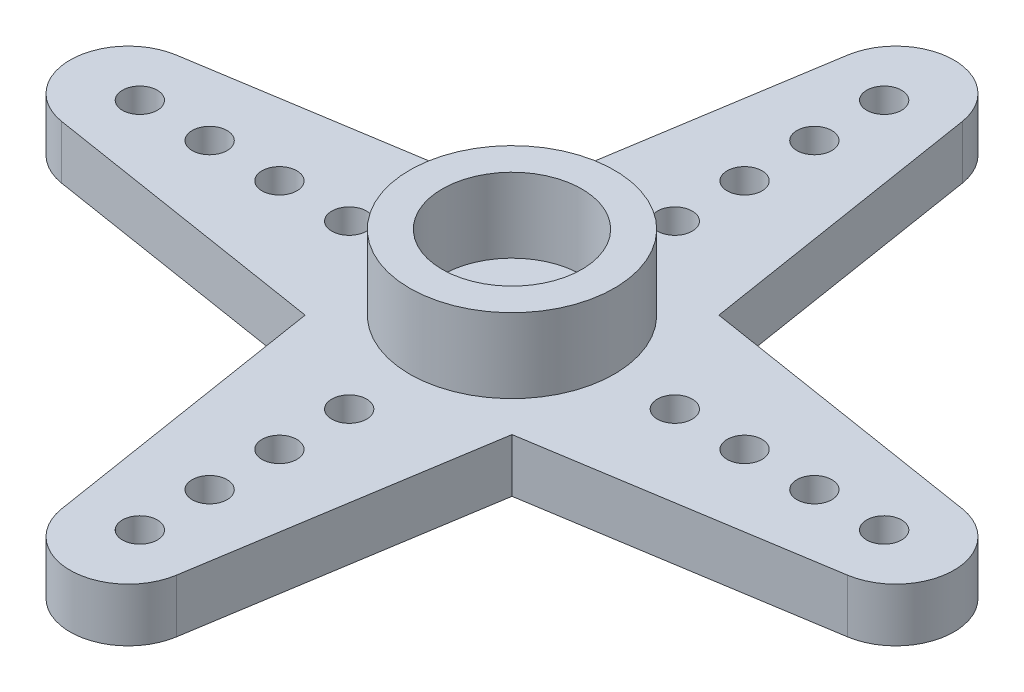
ISO-10303-21;
HEADER;
FILE_DESCRIPTION(('STEP AP214'),'2;1');
FILE_NAME('part.step','',(''),(''),'','','');
FILE_SCHEMA(('AUTOMOTIVE_DESIGN { 1 0 10303 214 1 1 1 1 }'));
ENDSEC;
DATA;
#1=APPLICATION_CONTEXT('core data for automotive mechanical design processes');
#2=APPLICATION_PROTOCOL_DEFINITION('international standard','automotive_design',2000,#1);
#3=PRODUCT_CONTEXT('',#1,'mechanical');
#4=PRODUCT('Part','Part','',(#3));
#5=PRODUCT_RELATED_PRODUCT_CATEGORY('part','',(#4));
#6=PRODUCT_DEFINITION_FORMATION('','',#4);
#7=PRODUCT_DEFINITION_CONTEXT('part definition',#1,'design');
#8=PRODUCT_DEFINITION('design','',#6,#7);
#9=PRODUCT_DEFINITION_SHAPE('','',#8);
#10=(LENGTH_UNIT() NAMED_UNIT(*) SI_UNIT(.MILLI.,.METRE.));
#11=(NAMED_UNIT(*) PLANE_ANGLE_UNIT() SI_UNIT($,.RADIAN.));
#12=(NAMED_UNIT(*) SI_UNIT($,.STERADIAN.) SOLID_ANGLE_UNIT());
#13=UNCERTAINTY_MEASURE_WITH_UNIT(LENGTH_MEASURE(1.E-05),#10,'distance_accuracy_value','');
#14=(GEOMETRIC_REPRESENTATION_CONTEXT(3) GLOBAL_UNCERTAINTY_ASSIGNED_CONTEXT((#13)) GLOBAL_UNIT_ASSIGNED_CONTEXT((#10,
#11,#12)) REPRESENTATION_CONTEXT('',''));
#15=CARTESIAN_POINT('',(0.,0.,0.));
#16=DIRECTION('',(0.,0.,1.));
#17=DIRECTION('',(1.,0.,0.));
#18=AXIS2_PLACEMENT_3D('',#15,#16,#17);
#19=CARTESIAN_POINT('',(5.02767726414761,2.3,-0.799360567392308));
#20=DIRECTION('',(0.987595455307073,0.,-0.157019797021949));
#21=DIRECTION('',(-0.157019797021949,0.,-0.987595455307074));
#22=AXIS2_PLACEMENT_3D('',#19,#20,#21);
#23=PLANE('',#22);
#24=DIRECTION('',(0.157019797021949,0.,0.987595455307074));
#25=VECTOR('',#24,1.);
#26=CARTESIAN_POINT('',(5.02767726414761,2.3,-0.799360567392308));
#27=LINE('',#26,#25);
#28=CARTESIAN_POINT('',(2.46898863826769,2.3,-16.8925494925549));
#29=VERTEX_POINT('',#28);
#30=CARTESIAN_POINT('',(4.44763132459011,2.3,-4.44763132459009));
#31=VERTEX_POINT('',#30);
#32=EDGE_CURVE('E112',#29,#31,#27,.T.);
#33=ORIENTED_EDGE('',*,*,#32,.T.);
#34=DIRECTION('',(0.,-1.,0.));
#35=VECTOR('',#34,1.);
#36=CARTESIAN_POINT('',(4.44763132459011,2.3,-4.44763132459009));
#37=LINE('',#36,#35);
#38=CARTESIAN_POINT('',(4.44763132459011,0.,-4.44763132459009));
#39=VERTEX_POINT('',#38);
#40=EDGE_CURVE('E11',#31,#39,#37,.T.);
#41=ORIENTED_EDGE('',*,*,#40,.T.);
#42=DIRECTION('',(0.157019797021949,0.,0.987595455307074));
#43=VECTOR('',#42,1.);
#44=CARTESIAN_POINT('',(5.02767726414761,0.,-0.799360567392308));
#45=LINE('',#44,#43);
#46=CARTESIAN_POINT('',(2.46898863826769,0.,-16.8925494925549));
#47=VERTEX_POINT('',#46);
#48=EDGE_CURVE('E94',#47,#39,#45,.T.);
#49=ORIENTED_EDGE('',*,*,#48,.F.);
#50=DIRECTION('',(0.,-1.,0.));
#51=VECTOR('',#50,1.);
#52=CARTESIAN_POINT('',(2.46898863826769,2.3,-16.8925494925549));
#53=LINE('',#52,#51);
#54=EDGE_CURVE('E66',#29,#47,#53,.T.);
#55=ORIENTED_EDGE('',*,*,#54,.F.);
#56=EDGE_LOOP('',(#33,#41,#49,#55));
#57=FACE_BOUND('',#56,.T.);
#58=ADVANCED_FACE('F41',(#57),#23,.T.);
#59=CARTESIAN_POINT('',(0.,2.3,0.));
#60=DIRECTION('',(0.,1.,0.));
#61=DIRECTION('',(0.,0.,1.));
#62=AXIS2_PLACEMENT_3D('',#59,#60,#61);
#63=PLANE('',#62);
#64=CARTESIAN_POINT('',(0.,2.3,0.));
#65=DIRECTION('',(0.,1.,0.));
#66=DIRECTION('',(0.,0.,1.));
#67=AXIS2_PLACEMENT_3D('',#64,#65,#66);
#68=CIRCLE('',#67,1.5);
#69=CARTESIAN_POINT('',(0.,2.3,1.5));
#70=VERTEX_POINT('',#69);
#71=EDGE_CURVE('E129',#70,#70,#68,.T.);
#72=ORIENTED_EDGE('',*,*,#71,.F.);
#73=EDGE_LOOP('',(#72));
#74=FACE_BOUND('',#73,.T.);
#75=CARTESIAN_POINT('',(0.,2.3,0.));
#76=DIRECTION('',(0.,1.,0.));
#77=DIRECTION('',(0.,0.,1.));
#78=AXIS2_PLACEMENT_3D('',#75,#76,#77);
#79=CIRCLE('',#78,3.);
#80=CARTESIAN_POINT('',(0.,2.3,3.));
#81=VERTEX_POINT('',#80);
#82=EDGE_CURVE('E85',#81,#81,#79,.T.);
#83=ORIENTED_EDGE('',*,*,#82,.T.);
#84=EDGE_LOOP('',(#83));
#85=FACE_BOUND('',#84,.T.);
#86=ADVANCED_FACE('F409',(#74,#85),#63,.T.);
#87=DIRECTION('',(-0.987595455307073,0.,-0.157019797021953));
#88=VECTOR('',#87,1.);
#89=CARTESIAN_POINT('',(0.799360567392327,2.3,-5.0276772641476));
#90=LINE('',#89,#88);
#91=CARTESIAN_POINT('',(16.8925494925549,2.3,-2.46898863826762));
#92=VERTEX_POINT('',#91);
#93=EDGE_CURVE('E194',#92,#31,#90,.T.);
#94=ORIENTED_EDGE('',*,*,#93,.T.);
#95=ORIENTED_EDGE('',*,*,#32,.F.);
#96=CARTESIAN_POINT('',(0.,2.3,-16.5));
#97=DIRECTION('',(0.,-1.,0.));
#98=DIRECTION('',(0.,0.,-1.));
#99=AXIS2_PLACEMENT_3D('',#96,#97,#98);
#100=CIRCLE('',#99,2.5);
#101=CARTESIAN_POINT('',(-2.46898863826768,2.3,-16.8925494925549));
#102=VERTEX_POINT('',#101);
#103=EDGE_CURVE('E82',#102,#29,#100,.T.);
#104=ORIENTED_EDGE('',*,*,#103,.F.);
#105=DIRECTION('',(-0.15701979702195,0.,0.987595455307073));
#106=VECTOR('',#105,1.);
#107=CARTESIAN_POINT('',(-5.02767726414761,2.3,-0.799360567392309));
#108=LINE('',#107,#106);
#109=CARTESIAN_POINT('',(-4.4476313245901,2.3,-4.44763132459014));
#110=VERTEX_POINT('',#109);
#111=EDGE_CURVE('E140',#102,#110,#108,.T.);
#112=ORIENTED_EDGE('',*,*,#111,.T.);
#113=DIRECTION('',(0.987595455307075,0.,-0.157019797021939));
#114=VECTOR('',#113,1.);
#115=CARTESIAN_POINT('',(-0.799360567392255,2.3,-5.02767726414762));
#116=LINE('',#115,#114);
#117=CARTESIAN_POINT('',(-16.8925494925548,2.3,-2.46898863826786));
#118=VERTEX_POINT('',#117);
#119=EDGE_CURVE('E57',#118,#110,#116,.T.);
#120=ORIENTED_EDGE('',*,*,#119,.F.);
#121=CARTESIAN_POINT('',(-16.5,2.3,-1.74848993491328E-13));
#122=DIRECTION('',(0.,-1.,0.));
#123=DIRECTION('',(-1.,0.,0.));
#124=AXIS2_PLACEMENT_3D('',#121,#122,#123);
#125=CIRCLE('',#124,2.5);
#126=CARTESIAN_POINT('',(-16.8925494925549,2.3,2.46898863826751));
#127=VERTEX_POINT('',#126);
#128=EDGE_CURVE('E323',#127,#118,#125,.T.);
#129=ORIENTED_EDGE('',*,*,#128,.F.);
#130=DIRECTION('',(0.987595455307072,0.,0.15701979702196));
#131=VECTOR('',#130,1.);
#132=CARTESIAN_POINT('',(-0.799360567392362,2.3,5.0276772641476));
#133=LINE('',#132,#131);
#134=CARTESIAN_POINT('',(-4.44763132459011,2.3,4.44763132459006));
#135=VERTEX_POINT('',#134);
#136=EDGE_CURVE('E327',#127,#135,#133,.T.);
#137=ORIENTED_EDGE('',*,*,#136,.T.);
#138=DIRECTION('',(-0.157019797021949,0.,-0.987595455307074));
#139=VECTOR('',#138,1.);
#140=CARTESIAN_POINT('',(-5.02767726414761,2.3,0.799360567392308));
#141=LINE('',#140,#139);
#142=CARTESIAN_POINT('',(-2.46898863826769,2.3,16.8925494925549));
#143=VERTEX_POINT('',#142);
#144=EDGE_CURVE('E253',#143,#135,#141,.T.);
#145=ORIENTED_EDGE('',*,*,#144,.F.);
#146=CARTESIAN_POINT('',(0.,2.3,16.5));
#147=DIRECTION('',(0.,-1.,0.));
#148=DIRECTION('',(0.,0.,1.));
#149=AXIS2_PLACEMENT_3D('',#146,#147,#148);
#150=CIRCLE('',#149,2.5);
#151=CARTESIAN_POINT('',(2.46898863826768,2.3,16.8925494925549));
#152=VERTEX_POINT('',#151);
#153=EDGE_CURVE('E257',#152,#143,#150,.T.);
#154=ORIENTED_EDGE('',*,*,#153,.F.);
#155=DIRECTION('',(0.15701979702195,0.,-0.987595455307073));
#156=VECTOR('',#155,1.);
#157=CARTESIAN_POINT('',(5.02767726414761,2.3,0.799360567392309));
#158=LINE('',#157,#156);
#159=CARTESIAN_POINT('',(4.4476313245901,2.3,4.44763132459012));
#160=VERTEX_POINT('',#159);
#161=EDGE_CURVE('E261',#152,#160,#158,.T.);
#162=ORIENTED_EDGE('',*,*,#161,.T.);
#163=DIRECTION('',(-0.987595455307074,0.,0.157019797021946));
#164=VECTOR('',#163,1.);
#165=CARTESIAN_POINT('',(0.79936056739229,2.3,5.02767726414761));
#166=LINE('',#165,#164);
#167=CARTESIAN_POINT('',(16.8925494925549,2.3,2.46898863826775));
#168=VERTEX_POINT('',#167);
#169=EDGE_CURVE('E186',#168,#160,#166,.T.);
#170=ORIENTED_EDGE('',*,*,#169,.F.);
#171=CARTESIAN_POINT('',(16.5,2.3,0.));
#172=DIRECTION('',(0.,-1.,0.));
#173=DIRECTION('',(1.,0.,0.));
#174=AXIS2_PLACEMENT_3D('',#171,#172,#173);
#175=CIRCLE('',#174,2.5);
#176=EDGE_CURVE('E190',#92,#168,#175,.T.);
#177=ORIENTED_EDGE('',*,*,#176,.F.);
#178=EDGE_LOOP('',(#94,#95,#104,#112,#120,#129,#137,#145,#154,#162,#170,#177));
#179=FACE_BOUND('',#178,.T.);
#180=CARTESIAN_POINT('',(16.,2.3,0.));
#181=DIRECTION('',(0.,-1.,0.));
#182=DIRECTION('',(1.,0.,0.));
#183=AXIS2_PLACEMENT_3D('',#180,#181,#182);
#184=CIRCLE('',#183,0.75);
#185=CARTESIAN_POINT('',(16.75,2.3,0.));
#186=VERTEX_POINT('',#185);
#187=EDGE_CURVE('E197',#186,#186,#184,.T.);
#188=ORIENTED_EDGE('',*,*,#187,.T.);
#189=EDGE_LOOP('',(#188));
#190=FACE_BOUND('',#189,.T.);
#191=CARTESIAN_POINT('',(13.,2.3,0.));
#192=DIRECTION('',(0.,-1.,0.));
#193=DIRECTION('',(1.,0.,0.));
#194=AXIS2_PLACEMENT_3D('',#191,#192,#193);
#195=CIRCLE('',#194,0.750000000000001);
#196=CARTESIAN_POINT('',(13.75,2.3,0.));
#197=VERTEX_POINT('',#196);
#198=EDGE_CURVE('E201',#197,#197,#195,.T.);
#199=ORIENTED_EDGE('',*,*,#198,.T.);
#200=EDGE_LOOP('',(#199));
#201=FACE_BOUND('',#200,.T.);
#202=CARTESIAN_POINT('',(10.,2.3,0.));
#203=DIRECTION('',(0.,-1.,0.));
#204=DIRECTION('',(1.,0.,0.));
#205=AXIS2_PLACEMENT_3D('',#202,#203,#204);
#206=CIRCLE('',#205,0.750000000000001);
#207=CARTESIAN_POINT('',(10.75,2.3,0.));
#208=VERTEX_POINT('',#207);
#209=EDGE_CURVE('E205',#208,#208,#206,.T.);
#210=ORIENTED_EDGE('',*,*,#209,.T.);
#211=EDGE_LOOP('',(#210));
#212=FACE_BOUND('',#211,.T.);
#213=CARTESIAN_POINT('',(7.,2.3,0.));
#214=DIRECTION('',(0.,-1.,0.));
#215=DIRECTION('',(1.,0.,0.));
#216=AXIS2_PLACEMENT_3D('',#213,#214,#215);
#217=CIRCLE('',#216,0.75);
#218=CARTESIAN_POINT('',(7.75,2.3,0.));
#219=VERTEX_POINT('',#218);
#220=EDGE_CURVE('E209',#219,#219,#217,.T.);
#221=ORIENTED_EDGE('',*,*,#220,.T.);
#222=EDGE_LOOP('',(#221));
#223=FACE_BOUND('',#222,.T.);
#224=CARTESIAN_POINT('',(0.,2.3,16.));
#225=DIRECTION('',(0.,-1.,0.));
#226=DIRECTION('',(0.,0.,1.));
#227=AXIS2_PLACEMENT_3D('',#224,#225,#226);
#228=CIRCLE('',#227,0.75);
#229=CARTESIAN_POINT('',(0.,2.3,16.75));
#230=VERTEX_POINT('',#229);
#231=EDGE_CURVE('E265',#230,#230,#228,.T.);
#232=ORIENTED_EDGE('',*,*,#231,.T.);
#233=EDGE_LOOP('',(#232));
#234=FACE_BOUND('',#233,.T.);
#235=CARTESIAN_POINT('',(0.,2.3,13.));
#236=DIRECTION('',(0.,-1.,0.));
#237=DIRECTION('',(0.,0.,1.));
#238=AXIS2_PLACEMENT_3D('',#235,#236,#237);
#239=CIRCLE('',#238,0.750000000000001);
#240=CARTESIAN_POINT('',(0.,2.3,13.75));
#241=VERTEX_POINT('',#240);
#242=EDGE_CURVE('E269',#241,#241,#239,.T.);
#243=ORIENTED_EDGE('',*,*,#242,.T.);
#244=EDGE_LOOP('',(#243));
#245=FACE_BOUND('',#244,.T.);
#246=CARTESIAN_POINT('',(0.,2.3,10.));
#247=DIRECTION('',(0.,-1.,0.));
#248=DIRECTION('',(0.,0.,1.));
#249=AXIS2_PLACEMENT_3D('',#246,#247,#248);
#250=CIRCLE('',#249,0.750000000000001);
#251=CARTESIAN_POINT('',(0.,2.3,10.75));
#252=VERTEX_POINT('',#251);
#253=EDGE_CURVE('E273',#252,#252,#250,.T.);
#254=ORIENTED_EDGE('',*,*,#253,.T.);
#255=EDGE_LOOP('',(#254));
#256=FACE_BOUND('',#255,.T.);
#257=CARTESIAN_POINT('',(0.,2.3,7.));
#258=DIRECTION('',(0.,-1.,0.));
#259=DIRECTION('',(0.,0.,1.));
#260=AXIS2_PLACEMENT_3D('',#257,#258,#259);
#261=CIRCLE('',#260,0.75);
#262=CARTESIAN_POINT('',(0.,2.3,7.75));
#263=VERTEX_POINT('',#262);
#264=EDGE_CURVE('E277',#263,#263,#261,.T.);
#265=ORIENTED_EDGE('',*,*,#264,.T.);
#266=EDGE_LOOP('',(#265));
#267=FACE_BOUND('',#266,.T.);
#268=CARTESIAN_POINT('',(-7.,2.3,0.));
#269=DIRECTION('',(0.,-1.,0.));
#270=DIRECTION('',(-1.,0.,0.));
#271=AXIS2_PLACEMENT_3D('',#268,#269,#270);
#272=CIRCLE('',#271,0.75);
#273=CARTESIAN_POINT('',(-7.75,2.3,0.));
#274=VERTEX_POINT('',#273);
#275=EDGE_CURVE('E343',#274,#274,#272,.T.);
#276=ORIENTED_EDGE('',*,*,#275,.T.);
#277=EDGE_LOOP('',(#276));
#278=FACE_BOUND('',#277,.T.);
#279=CARTESIAN_POINT('',(-10.,2.3,-1.05969086964441E-13));
#280=DIRECTION('',(0.,-1.,0.));
#281=DIRECTION('',(-1.,0.,0.));
#282=AXIS2_PLACEMENT_3D('',#279,#280,#281);
#283=CIRCLE('',#282,0.750000000000001);
#284=CARTESIAN_POINT('',(-10.75,2.3,-1.13824919976838E-13));
#285=VERTEX_POINT('',#284);
#286=EDGE_CURVE('E339',#285,#285,#283,.T.);
#287=ORIENTED_EDGE('',*,*,#286,.T.);
#288=EDGE_LOOP('',(#287));
#289=FACE_BOUND('',#288,.T.);
#290=CARTESIAN_POINT('',(-13.,2.3,-1.37759813053774E-13));
#291=DIRECTION('',(0.,-1.,0.));
#292=DIRECTION('',(-1.,0.,0.));
#293=AXIS2_PLACEMENT_3D('',#290,#291,#292);
#294=CIRCLE('',#293,0.750000000000001);
#295=CARTESIAN_POINT('',(-13.75,2.3,-1.45615646066171E-13));
#296=VERTEX_POINT('',#295);
#297=EDGE_CURVE('E335',#296,#296,#294,.T.);
#298=ORIENTED_EDGE('',*,*,#297,.T.);
#299=EDGE_LOOP('',(#298));
#300=FACE_BOUND('',#299,.T.);
#301=CARTESIAN_POINT('',(-16.,2.3,-1.69550539143106E-13));
#302=DIRECTION('',(0.,-1.,0.));
#303=DIRECTION('',(-1.,0.,0.));
#304=AXIS2_PLACEMENT_3D('',#301,#302,#303);
#305=CIRCLE('',#304,0.75);
#306=CARTESIAN_POINT('',(-16.75,2.3,-1.77406372155503E-13));
#307=VERTEX_POINT('',#306);
#308=EDGE_CURVE('E331',#307,#307,#305,.T.);
#309=ORIENTED_EDGE('',*,*,#308,.T.);
#310=EDGE_LOOP('',(#309));
#311=FACE_BOUND('',#310,.T.);
#312=CARTESIAN_POINT('',(0.,2.3,0.));
#313=DIRECTION('',(0.,1.,0.));
#314=DIRECTION('',(0.,0.,1.));
#315=AXIS2_PLACEMENT_3D('',#312,#313,#314);
#316=CIRCLE('',#315,4.4);
#317=CARTESIAN_POINT('',(0.,2.3,4.4));
#318=VERTEX_POINT('',#317);
#319=EDGE_CURVE('E125',#318,#318,#316,.T.);
#320=ORIENTED_EDGE('',*,*,#319,.F.);
#321=EDGE_LOOP('',(#320));
#322=FACE_BOUND('',#321,.T.);
#323=CARTESIAN_POINT('',(0.,2.3,-7.));
#324=DIRECTION('',(0.,-1.,0.));
#325=DIRECTION('',(0.,0.,-1.));
#326=AXIS2_PLACEMENT_3D('',#323,#324,#325);
#327=CIRCLE('',#326,0.75);
#328=CARTESIAN_POINT('',(0.,2.3,-7.75));
#329=VERTEX_POINT('',#328);
#330=EDGE_CURVE('E102',#329,#329,#327,.T.);
#331=ORIENTED_EDGE('',*,*,#330,.T.);
#332=EDGE_LOOP('',(#331));
#333=FACE_BOUND('',#332,.T.);
#334=CARTESIAN_POINT('',(0.,2.3,-10.));
#335=DIRECTION('',(0.,-1.,0.));
#336=DIRECTION('',(0.,0.,-1.));
#337=AXIS2_PLACEMENT_3D('',#334,#335,#336);
#338=CIRCLE('',#337,0.750000000000001);
#339=CARTESIAN_POINT('',(0.,2.3,-10.75));
#340=VERTEX_POINT('',#339);
#341=EDGE_CURVE('E106',#340,#340,#338,.T.);
#342=ORIENTED_EDGE('',*,*,#341,.T.);
#343=EDGE_LOOP('',(#342));
#344=FACE_BOUND('',#343,.T.);
#345=CARTESIAN_POINT('',(0.,2.3,-13.));
#346=DIRECTION('',(0.,-1.,0.));
#347=DIRECTION('',(0.,0.,-1.));
#348=AXIS2_PLACEMENT_3D('',#345,#346,#347);
#349=CIRCLE('',#348,0.750000000000001);
#350=CARTESIAN_POINT('',(0.,2.3,-13.75));
#351=VERTEX_POINT('',#350);
#352=EDGE_CURVE('E156',#351,#351,#349,.T.);
#353=ORIENTED_EDGE('',*,*,#352,.T.);
#354=EDGE_LOOP('',(#353));
#355=FACE_BOUND('',#354,.T.);
#356=CARTESIAN_POINT('',(0.,2.3,-16.));
#357=DIRECTION('',(0.,-1.,0.));
#358=DIRECTION('',(0.,0.,-1.));
#359=AXIS2_PLACEMENT_3D('',#356,#357,#358);
#360=CIRCLE('',#359,0.75);
#361=CARTESIAN_POINT('',(0.,2.3,-16.75));
#362=VERTEX_POINT('',#361);
#363=EDGE_CURVE('E150',#362,#362,#360,.T.);
#364=ORIENTED_EDGE('',*,*,#363,.T.);
#365=EDGE_LOOP('',(#364));
#366=FACE_BOUND('',#365,.T.);
#367=ADVANCED_FACE('F145',(#179,#190,#201,#212,#223,#234,#245,#256,#267,#278,#289,#300,#311,
#322,#333,#344,#355,#366),#63,.T.);
#368=CARTESIAN_POINT('',(0.,0.,0.));
#369=DIRECTION('',(0.,1.,0.));
#370=DIRECTION('',(0.,0.,1.));
#371=AXIS2_PLACEMENT_3D('',#368,#369,#370);
#372=PLANE('',#371);
#373=ORIENTED_EDGE('',*,*,#48,.T.);
#374=DIRECTION('',(-0.987595455307073,0.,-0.157019797021953));
#375=VECTOR('',#374,1.);
#376=CARTESIAN_POINT('',(0.799360567392327,0.,-5.0276772641476));
#377=LINE('',#376,#375);
#378=CARTESIAN_POINT('',(16.8925494925549,0.,-2.46898863826762));
#379=VERTEX_POINT('',#378);
#380=EDGE_CURVE('E221',#379,#39,#377,.T.);
#381=ORIENTED_EDGE('',*,*,#380,.F.);
#382=CARTESIAN_POINT('',(16.5,0.,0.));
#383=DIRECTION('',(0.,-1.,0.));
#384=DIRECTION('',(1.,0.,0.));
#385=AXIS2_PLACEMENT_3D('',#382,#383,#384);
#386=CIRCLE('',#385,2.5);
#387=CARTESIAN_POINT('',(16.8925494925549,0.,2.46898863826775));
#388=VERTEX_POINT('',#387);
#389=EDGE_CURVE('E217',#379,#388,#386,.T.);
#390=ORIENTED_EDGE('',*,*,#389,.T.);
#391=DIRECTION('',(-0.987595455307074,0.,0.157019797021946));
#392=VECTOR('',#391,1.);
#393=CARTESIAN_POINT('',(0.79936056739229,0.,5.02767726414761));
#394=LINE('',#393,#392);
#395=CARTESIAN_POINT('',(4.4476313245901,0.,4.44763132459012));
#396=VERTEX_POINT('',#395);
#397=EDGE_CURVE('E213',#388,#396,#394,.T.);
#398=ORIENTED_EDGE('',*,*,#397,.T.);
#399=DIRECTION('',(0.15701979702195,0.,-0.987595455307073));
#400=VECTOR('',#399,1.);
#401=CARTESIAN_POINT('',(5.02767726414761,0.,0.799360567392309));
#402=LINE('',#401,#400);
#403=CARTESIAN_POINT('',(2.46898863826768,0.,16.8925494925549));
#404=VERTEX_POINT('',#403);
#405=EDGE_CURVE('E289',#404,#396,#402,.T.);
#406=ORIENTED_EDGE('',*,*,#405,.F.);
#407=CARTESIAN_POINT('',(0.,0.,16.5));
#408=DIRECTION('',(0.,-1.,0.));
#409=DIRECTION('',(0.,0.,1.));
#410=AXIS2_PLACEMENT_3D('',#407,#408,#409);
#411=CIRCLE('',#410,2.5);
#412=CARTESIAN_POINT('',(-2.46898863826769,0.,16.8925494925549));
#413=VERTEX_POINT('',#412);
#414=EDGE_CURVE('E285',#404,#413,#411,.T.);
#415=ORIENTED_EDGE('',*,*,#414,.T.);
#416=DIRECTION('',(-0.157019797021949,0.,-0.987595455307074));
#417=VECTOR('',#416,1.);
#418=CARTESIAN_POINT('',(-5.02767726414761,0.,0.799360567392308));
#419=LINE('',#418,#417);
#420=CARTESIAN_POINT('',(-4.44763132459011,0.,4.44763132459006));
#421=VERTEX_POINT('',#420);
#422=EDGE_CURVE('E281',#413,#421,#419,.T.);
#423=ORIENTED_EDGE('',*,*,#422,.T.);
#424=DIRECTION('',(0.987595455307072,0.,0.15701979702196));
#425=VECTOR('',#424,1.);
#426=CARTESIAN_POINT('',(-0.799360567392362,0.,5.0276772641476));
#427=LINE('',#426,#425);
#428=CARTESIAN_POINT('',(-16.8925494925549,0.,2.46898863826751));
#429=VERTEX_POINT('',#428);
#430=EDGE_CURVE('E354',#429,#421,#427,.T.);
#431=ORIENTED_EDGE('',*,*,#430,.F.);
#432=CARTESIAN_POINT('',(-16.5,0.,-1.74848993491328E-13));
#433=DIRECTION('',(0.,-1.,0.));
#434=DIRECTION('',(-1.,0.,0.));
#435=AXIS2_PLACEMENT_3D('',#432,#433,#434);
#436=CIRCLE('',#435,2.5);
#437=CARTESIAN_POINT('',(-16.8925494925548,0.,-2.46898863826786));
#438=VERTEX_POINT('',#437);
#439=EDGE_CURVE('E350',#429,#438,#436,.T.);
#440=ORIENTED_EDGE('',*,*,#439,.T.);
#441=DIRECTION('',(0.987595455307075,0.,-0.157019797021939));
#442=VECTOR('',#441,1.);
#443=CARTESIAN_POINT('',(-0.799360567392255,0.,-5.02767726414762));
#444=LINE('',#443,#442);
#445=CARTESIAN_POINT('',(-4.4476313245901,0.,-4.44763132459014));
#446=VERTEX_POINT('',#445);
#447=EDGE_CURVE('E347',#438,#446,#444,.T.);
#448=ORIENTED_EDGE('',*,*,#447,.T.);
#449=DIRECTION('',(-0.15701979702195,0.,0.987595455307073));
#450=VECTOR('',#449,1.);
#451=CARTESIAN_POINT('',(-5.02767726414761,0.,-0.799360567392309));
#452=LINE('',#451,#450);
#453=CARTESIAN_POINT('',(-2.46898863826768,0.,-16.8925494925549));
#454=VERTEX_POINT('',#453);
#455=EDGE_CURVE('E97',#454,#446,#452,.T.);
#456=ORIENTED_EDGE('',*,*,#455,.F.);
#457=CARTESIAN_POINT('',(0.,0.,-16.5));
#458=DIRECTION('',(0.,-1.,0.));
#459=DIRECTION('',(0.,0.,-1.));
#460=AXIS2_PLACEMENT_3D('',#457,#458,#459);
#461=CIRCLE('',#460,2.5);
#462=EDGE_CURVE('E80',#454,#47,#461,.T.);
#463=ORIENTED_EDGE('',*,*,#462,.T.);
#464=EDGE_LOOP('',(#373,#381,#390,#398,#406,#415,#423,#431,#440,#448,#456,#463));
#465=FACE_BOUND('',#464,.T.);
#466=CARTESIAN_POINT('',(-16.,0.,-1.69550539143106E-13));
#467=DIRECTION('',(0.,-1.,0.));
#468=DIRECTION('',(-1.,0.,0.));
#469=AXIS2_PLACEMENT_3D('',#466,#467,#468);
#470=CIRCLE('',#469,0.75);
#471=CARTESIAN_POINT('',(-16.75,0.,-1.77406372155503E-13));
#472=VERTEX_POINT('',#471);
#473=EDGE_CURVE('E358',#472,#472,#470,.T.);
#474=ORIENTED_EDGE('',*,*,#473,.F.);
#475=EDGE_LOOP('',(#474));
#476=FACE_BOUND('',#475,.T.);
#477=CARTESIAN_POINT('',(-13.,0.,-1.37759813053774E-13));
#478=DIRECTION('',(0.,-1.,0.));
#479=DIRECTION('',(-1.,0.,0.));
#480=AXIS2_PLACEMENT_3D('',#477,#478,#479);
#481=CIRCLE('',#480,0.750000000000001);
#482=CARTESIAN_POINT('',(-13.75,0.,-1.45615646066171E-13));
#483=VERTEX_POINT('',#482);
#484=EDGE_CURVE('E362',#483,#483,#481,.T.);
#485=ORIENTED_EDGE('',*,*,#484,.F.);
#486=EDGE_LOOP('',(#485));
#487=FACE_BOUND('',#486,.T.);
#488=CARTESIAN_POINT('',(-10.,0.,-1.05969086964441E-13));
#489=DIRECTION('',(0.,-1.,0.));
#490=DIRECTION('',(-1.,0.,0.));
#491=AXIS2_PLACEMENT_3D('',#488,#489,#490);
#492=CIRCLE('',#491,0.750000000000001);
#493=CARTESIAN_POINT('',(-10.75,0.,-1.13824919976838E-13));
#494=VERTEX_POINT('',#493);
#495=EDGE_CURVE('E366',#494,#494,#492,.T.);
#496=ORIENTED_EDGE('',*,*,#495,.F.);
#497=EDGE_LOOP('',(#496));
#498=FACE_BOUND('',#497,.T.);
#499=CARTESIAN_POINT('',(-7.,0.,0.));
#500=DIRECTION('',(0.,-1.,0.));
#501=DIRECTION('',(-1.,0.,0.));
#502=AXIS2_PLACEMENT_3D('',#499,#500,#501);
#503=CIRCLE('',#502,0.75);
#504=CARTESIAN_POINT('',(-7.75,0.,0.));
#505=VERTEX_POINT('',#504);
#506=EDGE_CURVE('E370',#505,#505,#503,.T.);
#507=ORIENTED_EDGE('',*,*,#506,.F.);
#508=EDGE_LOOP('',(#507));
#509=FACE_BOUND('',#508,.T.);
#510=CARTESIAN_POINT('',(0.,0.,16.));
#511=DIRECTION('',(0.,-1.,0.));
#512=DIRECTION('',(0.,0.,1.));
#513=AXIS2_PLACEMENT_3D('',#510,#511,#512);
#514=CIRCLE('',#513,0.75);
#515=CARTESIAN_POINT('',(0.,0.,16.75));
#516=VERTEX_POINT('',#515);
#517=EDGE_CURVE('E293',#516,#516,#514,.T.);
#518=ORIENTED_EDGE('',*,*,#517,.F.);
#519=EDGE_LOOP('',(#518));
#520=FACE_BOUND('',#519,.T.);
#521=CARTESIAN_POINT('',(0.,0.,13.));
#522=DIRECTION('',(0.,-1.,0.));
#523=DIRECTION('',(0.,0.,1.));
#524=AXIS2_PLACEMENT_3D('',#521,#522,#523);
#525=CIRCLE('',#524,0.750000000000001);
#526=CARTESIAN_POINT('',(0.,0.,13.75));
#527=VERTEX_POINT('',#526);
#528=EDGE_CURVE('E297',#527,#527,#525,.T.);
#529=ORIENTED_EDGE('',*,*,#528,.F.);
#530=EDGE_LOOP('',(#529));
#531=FACE_BOUND('',#530,.T.);
#532=CARTESIAN_POINT('',(0.,0.,10.));
#533=DIRECTION('',(0.,-1.,0.));
#534=DIRECTION('',(0.,0.,1.));
#535=AXIS2_PLACEMENT_3D('',#532,#533,#534);
#536=CIRCLE('',#535,0.750000000000001);
#537=CARTESIAN_POINT('',(0.,0.,10.75));
#538=VERTEX_POINT('',#537);
#539=EDGE_CURVE('E301',#538,#538,#536,.T.);
#540=ORIENTED_EDGE('',*,*,#539,.F.);
#541=EDGE_LOOP('',(#540));
#542=FACE_BOUND('',#541,.T.);
#543=CARTESIAN_POINT('',(0.,0.,7.));
#544=DIRECTION('',(0.,-1.,0.));
#545=DIRECTION('',(0.,0.,1.));
#546=AXIS2_PLACEMENT_3D('',#543,#544,#545);
#547=CIRCLE('',#546,0.75);
#548=CARTESIAN_POINT('',(0.,0.,7.75));
#549=VERTEX_POINT('',#548);
#550=EDGE_CURVE('E305',#549,#549,#547,.T.);
#551=ORIENTED_EDGE('',*,*,#550,.F.);
#552=EDGE_LOOP('',(#551));
#553=FACE_BOUND('',#552,.T.);
#554=CARTESIAN_POINT('',(16.,0.,0.));
#555=DIRECTION('',(0.,-1.,0.));
#556=DIRECTION('',(1.,0.,0.));
#557=AXIS2_PLACEMENT_3D('',#554,#555,#556);
#558=CIRCLE('',#557,0.75);
#559=CARTESIAN_POINT('',(16.75,0.,0.));
#560=VERTEX_POINT('',#559);
#561=EDGE_CURVE('E225',#560,#560,#558,.T.);
#562=ORIENTED_EDGE('',*,*,#561,.F.);
#563=EDGE_LOOP('',(#562));
#564=FACE_BOUND('',#563,.T.);
#565=CARTESIAN_POINT('',(13.,0.,0.));
#566=DIRECTION('',(0.,-1.,0.));
#567=DIRECTION('',(1.,0.,0.));
#568=AXIS2_PLACEMENT_3D('',#565,#566,#567);
#569=CIRCLE('',#568,0.750000000000001);
#570=CARTESIAN_POINT('',(13.75,0.,0.));
#571=VERTEX_POINT('',#570);
#572=EDGE_CURVE('E229',#571,#571,#569,.T.);
#573=ORIENTED_EDGE('',*,*,#572,.F.);
#574=EDGE_LOOP('',(#573));
#575=FACE_BOUND('',#574,.T.);
#576=CARTESIAN_POINT('',(10.,0.,0.));
#577=DIRECTION('',(0.,-1.,0.));
#578=DIRECTION('',(1.,0.,0.));
#579=AXIS2_PLACEMENT_3D('',#576,#577,#578);
#580=CIRCLE('',#579,0.750000000000001);
#581=CARTESIAN_POINT('',(10.75,0.,0.));
#582=VERTEX_POINT('',#581);
#583=EDGE_CURVE('E233',#582,#582,#580,.T.);
#584=ORIENTED_EDGE('',*,*,#583,.F.);
#585=EDGE_LOOP('',(#584));
#586=FACE_BOUND('',#585,.T.);
#587=CARTESIAN_POINT('',(7.,0.,0.));
#588=DIRECTION('',(0.,-1.,0.));
#589=DIRECTION('',(1.,0.,0.));
#590=AXIS2_PLACEMENT_3D('',#587,#588,#589);
#591=CIRCLE('',#590,0.75);
#592=CARTESIAN_POINT('',(7.75,0.,0.));
#593=VERTEX_POINT('',#592);
#594=EDGE_CURVE('E237',#593,#593,#591,.T.);
#595=ORIENTED_EDGE('',*,*,#594,.F.);
#596=EDGE_LOOP('',(#595));
#597=FACE_BOUND('',#596,.T.);
#598=CARTESIAN_POINT('',(0.,0.,0.));
#599=DIRECTION('',(0.,1.,0.));
#600=DIRECTION('',(0.,0.,1.));
#601=AXIS2_PLACEMENT_3D('',#598,#599,#600);
#602=CIRCLE('',#601,1.5);
#603=CARTESIAN_POINT('',(0.,0.,1.5));
#604=VERTEX_POINT('',#603);
#605=EDGE_CURVE('E124',#604,#604,#602,.T.);
#606=ORIENTED_EDGE('',*,*,#605,.T.);
#607=EDGE_LOOP('',(#606));
#608=FACE_BOUND('',#607,.T.);
#609=CARTESIAN_POINT('',(0.,0.,-7.));
#610=DIRECTION('',(0.,-1.,0.));
#611=DIRECTION('',(0.,0.,-1.));
#612=AXIS2_PLACEMENT_3D('',#609,#610,#611);
#613=CIRCLE('',#612,0.75);
#614=CARTESIAN_POINT('',(0.,0.,-7.75));
#615=VERTEX_POINT('',#614);
#616=EDGE_CURVE('E162',#615,#615,#613,.T.);
#617=ORIENTED_EDGE('',*,*,#616,.F.);
#618=EDGE_LOOP('',(#617));
#619=FACE_BOUND('',#618,.T.);
#620=CARTESIAN_POINT('',(0.,0.,-10.));
#621=DIRECTION('',(0.,-1.,0.));
#622=DIRECTION('',(0.,0.,-1.));
#623=AXIS2_PLACEMENT_3D('',#620,#621,#622);
#624=CIRCLE('',#623,0.750000000000001);
#625=CARTESIAN_POINT('',(0.,0.,-10.75));
#626=VERTEX_POINT('',#625);
#627=EDGE_CURVE('E166',#626,#626,#624,.T.);
#628=ORIENTED_EDGE('',*,*,#627,.F.);
#629=EDGE_LOOP('',(#628));
#630=FACE_BOUND('',#629,.T.);
#631=CARTESIAN_POINT('',(0.,0.,-13.));
#632=DIRECTION('',(0.,-1.,0.));
#633=DIRECTION('',(0.,0.,-1.));
#634=AXIS2_PLACEMENT_3D('',#631,#632,#633);
#635=CIRCLE('',#634,0.750000000000001);
#636=CARTESIAN_POINT('',(0.,0.,-13.75));
#637=VERTEX_POINT('',#636);
#638=EDGE_CURVE('E171',#637,#637,#635,.T.);
#639=ORIENTED_EDGE('',*,*,#638,.F.);
#640=EDGE_LOOP('',(#639));
#641=FACE_BOUND('',#640,.T.);
#642=CARTESIAN_POINT('',(0.,0.,-16.));
#643=DIRECTION('',(0.,-1.,0.));
#644=DIRECTION('',(0.,0.,-1.));
#645=AXIS2_PLACEMENT_3D('',#642,#643,#644);
#646=CIRCLE('',#645,0.75);
#647=CARTESIAN_POINT('',(0.,0.,-16.75));
#648=VERTEX_POINT('',#647);
#649=EDGE_CURVE('E175',#648,#648,#646,.T.);
#650=ORIENTED_EDGE('',*,*,#649,.F.);
#651=EDGE_LOOP('',(#650));
#652=FACE_BOUND('',#651,.T.);
#653=ADVANCED_FACE('F43',(#465,#476,#487,#498,#509,#520,#531,#542,#553,#564,#575,#586,#597,#608,
#619,#630,#641,#652),#372,.F.);
#654=CARTESIAN_POINT('',(0.,2.3,0.));
#655=DIRECTION('',(0.,-1.,0.));
#656=DIRECTION('',(0.,0.,-1.));
#657=AXIS2_PLACEMENT_3D('',#654,#655,#656);
#658=CYLINDRICAL_SURFACE('',#657,1.5);
#659=ORIENTED_EDGE('',*,*,#71,.T.);
#660=EDGE_LOOP('',(#659));
#661=FACE_BOUND('',#660,.T.);
#662=ORIENTED_EDGE('',*,*,#605,.F.);
#663=EDGE_LOOP('',(#662));
#664=FACE_BOUND('',#663,.T.);
#665=ADVANCED_FACE('F395',(#661,#664),#658,.F.);
#666=CARTESIAN_POINT('',(0.,5.5,0.));
#667=DIRECTION('',(0.,1.,0.));
#668=DIRECTION('',(0.,0.,1.));
#669=AXIS2_PLACEMENT_3D('',#666,#667,#668);
#670=PLANE('',#669);
#671=CARTESIAN_POINT('',(0.,5.5,0.));
#672=DIRECTION('',(0.,1.,0.));
#673=DIRECTION('',(0.,0.,1.));
#674=AXIS2_PLACEMENT_3D('',#671,#672,#673);
#675=CIRCLE('',#674,4.4);
#676=CARTESIAN_POINT('',(0.,5.5,4.4));
#677=VERTEX_POINT('',#676);
#678=EDGE_CURVE('E117',#677,#677,#675,.T.);
#679=ORIENTED_EDGE('',*,*,#678,.T.);
#680=EDGE_LOOP('',(#679));
#681=FACE_BOUND('',#680,.T.);
#682=CARTESIAN_POINT('',(0.,5.5,0.));
#683=DIRECTION('',(0.,1.,0.));
#684=DIRECTION('',(0.,0.,1.));
#685=AXIS2_PLACEMENT_3D('',#682,#683,#684);
#686=CIRCLE('',#685,3.);
#687=CARTESIAN_POINT('',(0.,5.5,3.));
#688=VERTEX_POINT('',#687);
#689=EDGE_CURVE('E113',#688,#688,#686,.T.);
#690=ORIENTED_EDGE('',*,*,#689,.F.);
#691=EDGE_LOOP('',(#690));
#692=FACE_BOUND('',#691,.T.);
#693=ADVANCED_FACE('F444',(#681,#692),#670,.T.);
#694=CARTESIAN_POINT('',(0.,5.5,0.));
#695=DIRECTION('',(0.,-1.,0.));
#696=DIRECTION('',(0.,0.,-1.));
#697=AXIS2_PLACEMENT_3D('',#694,#695,#696);
#698=CYLINDRICAL_SURFACE('',#697,4.4);
#699=ORIENTED_EDGE('',*,*,#678,.F.);
#700=EDGE_LOOP('',(#699));
#701=FACE_BOUND('',#700,.T.);
#702=ORIENTED_EDGE('',*,*,#319,.T.);
#703=EDGE_LOOP('',(#702));
#704=FACE_BOUND('',#703,.T.);
#705=ADVANCED_FACE('F442',(#701,#704),#698,.T.);
#706=CARTESIAN_POINT('',(0.,5.5,0.));
#707=DIRECTION('',(0.,-1.,0.));
#708=DIRECTION('',(0.,0.,-1.));
#709=AXIS2_PLACEMENT_3D('',#706,#707,#708);
#710=CYLINDRICAL_SURFACE('',#709,3.);
#711=ORIENTED_EDGE('',*,*,#689,.T.);
#712=EDGE_LOOP('',(#711));
#713=FACE_BOUND('',#712,.T.);
#714=ORIENTED_EDGE('',*,*,#82,.F.);
#715=EDGE_LOOP('',(#714));
#716=FACE_BOUND('',#715,.T.);
#717=ADVANCED_FACE('F404',(#713,#716),#710,.F.);
#718=CARTESIAN_POINT('',(0.,2.3,-16.5));
#719=DIRECTION('',(0.,-1.,0.));
#720=DIRECTION('',(0.,0.,-1.));
#721=AXIS2_PLACEMENT_3D('',#718,#719,#720);
#722=CYLINDRICAL_SURFACE('',#721,2.5);
#723=ORIENTED_EDGE('',*,*,#462,.F.);
#724=DIRECTION('',(0.,-1.,0.));
#725=VECTOR('',#724,1.);
#726=CARTESIAN_POINT('',(-2.46898863826768,2.3,-16.8925494925549));
#727=LINE('',#726,#725);
#728=EDGE_CURVE('E86',#102,#454,#727,.T.);
#729=ORIENTED_EDGE('',*,*,#728,.F.);
#730=ORIENTED_EDGE('',*,*,#103,.T.);
#731=ORIENTED_EDGE('',*,*,#54,.T.);
#732=EDGE_LOOP('',(#723,#729,#730,#731));
#733=FACE_BOUND('',#732,.T.);
#734=ADVANCED_FACE('F79',(#733),#722,.T.);
#735=CARTESIAN_POINT('',(0.,2.3,-16.));
#736=DIRECTION('',(0.,-1.,0.));
#737=DIRECTION('',(0.,0.,-1.));
#738=AXIS2_PLACEMENT_3D('',#735,#736,#737);
#739=CYLINDRICAL_SURFACE('',#738,0.75);
#740=ORIENTED_EDGE('',*,*,#363,.F.);
#741=EDGE_LOOP('',(#740));
#742=FACE_BOUND('',#741,.T.);
#743=ORIENTED_EDGE('',*,*,#649,.T.);
#744=EDGE_LOOP('',(#743));
#745=FACE_BOUND('',#744,.T.);
#746=ADVANCED_FACE('F389',(#742,#745),#739,.F.);
#747=CARTESIAN_POINT('',(0.,2.3,-13.));
#748=DIRECTION('',(0.,-1.,0.));
#749=DIRECTION('',(0.,0.,-1.));
#750=AXIS2_PLACEMENT_3D('',#747,#748,#749);
#751=CYLINDRICAL_SURFACE('',#750,0.750000000000001);
#752=ORIENTED_EDGE('',*,*,#352,.F.);
#753=EDGE_LOOP('',(#752));
#754=FACE_BOUND('',#753,.T.);
#755=ORIENTED_EDGE('',*,*,#638,.T.);
#756=EDGE_LOOP('',(#755));
#757=FACE_BOUND('',#756,.T.);
#758=ADVANCED_FACE('F385',(#754,#757),#751,.F.);
#759=CARTESIAN_POINT('',(0.,2.3,-10.));
#760=DIRECTION('',(0.,-1.,0.));
#761=DIRECTION('',(0.,0.,-1.));
#762=AXIS2_PLACEMENT_3D('',#759,#760,#761);
#763=CYLINDRICAL_SURFACE('',#762,0.750000000000001);
#764=ORIENTED_EDGE('',*,*,#341,.F.);
#765=EDGE_LOOP('',(#764));
#766=FACE_BOUND('',#765,.T.);
#767=ORIENTED_EDGE('',*,*,#627,.T.);
#768=EDGE_LOOP('',(#767));
#769=FACE_BOUND('',#768,.T.);
#770=ADVANCED_FACE('F388',(#766,#769),#763,.F.);
#771=CARTESIAN_POINT('',(0.,2.3,-7.));
#772=DIRECTION('',(0.,-1.,0.));
#773=DIRECTION('',(0.,0.,-1.));
#774=AXIS2_PLACEMENT_3D('',#771,#772,#773);
#775=CYLINDRICAL_SURFACE('',#774,0.75);
#776=ORIENTED_EDGE('',*,*,#330,.F.);
#777=EDGE_LOOP('',(#776));
#778=FACE_BOUND('',#777,.T.);
#779=ORIENTED_EDGE('',*,*,#616,.T.);
#780=EDGE_LOOP('',(#779));
#781=FACE_BOUND('',#780,.T.);
#782=ADVANCED_FACE('F422',(#778,#781),#775,.F.);
#783=CARTESIAN_POINT('',(-5.02767726414761,2.3,-0.799360567392309));
#784=DIRECTION('',(0.987595455307073,0.,0.15701979702195));
#785=DIRECTION('',(0.15701979702195,0.,-0.987595455307073));
#786=AXIS2_PLACEMENT_3D('',#783,#784,#785);
#787=PLANE('',#786);
#788=ORIENTED_EDGE('',*,*,#455,.T.);
#789=DIRECTION('',(0.,1.,0.));
#790=VECTOR('',#789,1.);
#791=CARTESIAN_POINT('',(-4.4476313245901,2.3,-4.44763132459014));
#792=LINE('',#791,#790);
#793=EDGE_CURVE('E50',#446,#110,#792,.T.);
#794=ORIENTED_EDGE('',*,*,#793,.T.);
#795=ORIENTED_EDGE('',*,*,#111,.F.);
#796=ORIENTED_EDGE('',*,*,#728,.T.);
#797=EDGE_LOOP('',(#788,#794,#795,#796));
#798=FACE_BOUND('',#797,.T.);
#799=ADVANCED_FACE('F139',(#798),#787,.F.);
#800=CARTESIAN_POINT('',(-0.799360567392255,2.3,-5.02767726414762));
#801=DIRECTION('',(-0.157019797021939,0.,-0.987595455307075));
#802=DIRECTION('',(-0.987595455307075,0.,0.157019797021939));
#803=AXIS2_PLACEMENT_3D('',#800,#801,#802);
#804=PLANE('',#803);
#805=ORIENTED_EDGE('',*,*,#793,.F.);
#806=ORIENTED_EDGE('',*,*,#447,.F.);
#807=DIRECTION('',(0.,-1.,0.));
#808=VECTOR('',#807,1.);
#809=CARTESIAN_POINT('',(-16.8925494925548,2.3,-2.46898863826786));
#810=LINE('',#809,#808);
#811=EDGE_CURVE('E313',#118,#438,#810,.T.);
#812=ORIENTED_EDGE('',*,*,#811,.F.);
#813=ORIENTED_EDGE('',*,*,#119,.T.);
#814=EDGE_LOOP('',(#805,#806,#812,#813));
#815=FACE_BOUND('',#814,.T.);
#816=ADVANCED_FACE('F421',(#815),#804,.T.);
#817=CARTESIAN_POINT('',(0.79936056739229,2.3,5.02767726414761));
#818=DIRECTION('',(0.157019797021946,0.,0.987595455307074));
#819=DIRECTION('',(0.987595455307074,0.,-0.157019797021946));
#820=AXIS2_PLACEMENT_3D('',#817,#818,#819);
#821=PLANE('',#820);
#822=ORIENTED_EDGE('',*,*,#169,.T.);
#823=DIRECTION('',(0.,-1.,0.));
#824=VECTOR('',#823,1.);
#825=CARTESIAN_POINT('',(4.4476313245901,2.3,4.44763132459012));
#826=LINE('',#825,#824);
#827=EDGE_CURVE('E241',#160,#396,#826,.T.);
#828=ORIENTED_EDGE('',*,*,#827,.T.);
#829=ORIENTED_EDGE('',*,*,#397,.F.);
#830=DIRECTION('',(0.,-1.,0.));
#831=VECTOR('',#830,1.);
#832=CARTESIAN_POINT('',(16.8925494925549,2.3,2.46898863826775));
#833=LINE('',#832,#831);
#834=EDGE_CURVE('E167',#168,#388,#833,.T.);
#835=ORIENTED_EDGE('',*,*,#834,.F.);
#836=EDGE_LOOP('',(#822,#828,#829,#835));
#837=FACE_BOUND('',#836,.T.);
#838=ADVANCED_FACE('F428',(#837),#821,.T.);
#839=CARTESIAN_POINT('',(16.5,2.3,0.));
#840=DIRECTION('',(0.,-1.,0.));
#841=DIRECTION('',(0.,0.,-1.));
#842=AXIS2_PLACEMENT_3D('',#839,#840,#841);
#843=CYLINDRICAL_SURFACE('',#842,2.5);
#844=ORIENTED_EDGE('',*,*,#389,.F.);
#845=DIRECTION('',(0.,-1.,0.));
#846=VECTOR('',#845,1.);
#847=CARTESIAN_POINT('',(16.8925494925549,2.3,-2.46898863826762));
#848=LINE('',#847,#846);
#849=EDGE_CURVE('E182',#92,#379,#848,.T.);
#850=ORIENTED_EDGE('',*,*,#849,.F.);
#851=ORIENTED_EDGE('',*,*,#176,.T.);
#852=ORIENTED_EDGE('',*,*,#834,.T.);
#853=EDGE_LOOP('',(#844,#850,#851,#852));
#854=FACE_BOUND('',#853,.T.);
#855=ADVANCED_FACE('F469',(#854),#843,.T.);
#856=CARTESIAN_POINT('',(16.,2.3,0.));
#857=DIRECTION('',(0.,-1.,0.));
#858=DIRECTION('',(0.,0.,-1.));
#859=AXIS2_PLACEMENT_3D('',#856,#857,#858);
#860=CYLINDRICAL_SURFACE('',#859,0.75);
#861=ORIENTED_EDGE('',*,*,#187,.F.);
#862=EDGE_LOOP('',(#861));
#863=FACE_BOUND('',#862,.T.);
#864=ORIENTED_EDGE('',*,*,#561,.T.);
#865=EDGE_LOOP('',(#864));
#866=FACE_BOUND('',#865,.T.);
#867=ADVANCED_FACE('F477',(#863,#866),#860,.F.);
#868=CARTESIAN_POINT('',(13.,2.3,0.));
#869=DIRECTION('',(0.,-1.,0.));
#870=DIRECTION('',(0.,0.,-1.));
#871=AXIS2_PLACEMENT_3D('',#868,#869,#870);
#872=CYLINDRICAL_SURFACE('',#871,0.750000000000001);
#873=ORIENTED_EDGE('',*,*,#198,.F.);
#874=EDGE_LOOP('',(#873));
#875=FACE_BOUND('',#874,.T.);
#876=ORIENTED_EDGE('',*,*,#572,.T.);
#877=EDGE_LOOP('',(#876));
#878=FACE_BOUND('',#877,.T.);
#879=ADVANCED_FACE('F485',(#875,#878),#872,.F.);
#880=CARTESIAN_POINT('',(10.,2.3,0.));
#881=DIRECTION('',(0.,-1.,0.));
#882=DIRECTION('',(0.,0.,-1.));
#883=AXIS2_PLACEMENT_3D('',#880,#881,#882);
#884=CYLINDRICAL_SURFACE('',#883,0.750000000000001);
#885=ORIENTED_EDGE('',*,*,#209,.F.);
#886=EDGE_LOOP('',(#885));
#887=FACE_BOUND('',#886,.T.);
#888=ORIENTED_EDGE('',*,*,#583,.T.);
#889=EDGE_LOOP('',(#888));
#890=FACE_BOUND('',#889,.T.);
#891=ADVANCED_FACE('F493',(#887,#890),#884,.F.);
#892=CARTESIAN_POINT('',(7.,2.3,0.));
#893=DIRECTION('',(0.,-1.,0.));
#894=DIRECTION('',(0.,0.,-1.));
#895=AXIS2_PLACEMENT_3D('',#892,#893,#894);
#896=CYLINDRICAL_SURFACE('',#895,0.75);
#897=ORIENTED_EDGE('',*,*,#220,.F.);
#898=EDGE_LOOP('',(#897));
#899=FACE_BOUND('',#898,.T.);
#900=ORIENTED_EDGE('',*,*,#594,.T.);
#901=EDGE_LOOP('',(#900));
#902=FACE_BOUND('',#901,.T.);
#903=ADVANCED_FACE('F418',(#899,#902),#896,.F.);
#904=CARTESIAN_POINT('',(0.799360567392327,2.3,-5.0276772641476));
#905=DIRECTION('',(-0.157019797021953,0.,0.987595455307073));
#906=DIRECTION('',(0.987595455307073,0.,0.157019797021953));
#907=AXIS2_PLACEMENT_3D('',#904,#905,#906);
#908=PLANE('',#907);
#909=ORIENTED_EDGE('',*,*,#40,.F.);
#910=ORIENTED_EDGE('',*,*,#93,.F.);
#911=ORIENTED_EDGE('',*,*,#849,.T.);
#912=ORIENTED_EDGE('',*,*,#380,.T.);
#913=EDGE_LOOP('',(#909,#910,#911,#912));
#914=FACE_BOUND('',#913,.T.);
#915=ADVANCED_FACE('F507',(#914),#908,.F.);
#916=CARTESIAN_POINT('',(-5.02767726414761,2.3,0.799360567392308));
#917=DIRECTION('',(-0.987595455307073,0.,0.157019797021949));
#918=DIRECTION('',(0.157019797021949,0.,0.987595455307074));
#919=AXIS2_PLACEMENT_3D('',#916,#917,#918);
#920=PLANE('',#919);
#921=ORIENTED_EDGE('',*,*,#144,.T.);
#922=DIRECTION('',(0.,-1.,0.));
#923=VECTOR('',#922,1.);
#924=CARTESIAN_POINT('',(-4.44763132459011,2.3,4.44763132459006));
#925=LINE('',#924,#923);
#926=EDGE_CURVE('E309',#135,#421,#925,.T.);
#927=ORIENTED_EDGE('',*,*,#926,.T.);
#928=ORIENTED_EDGE('',*,*,#422,.F.);
#929=DIRECTION('',(0.,-1.,0.));
#930=VECTOR('',#929,1.);
#931=CARTESIAN_POINT('',(-2.46898863826769,2.3,16.8925494925549));
#932=LINE('',#931,#930);
#933=EDGE_CURVE('E245',#143,#413,#932,.T.);
#934=ORIENTED_EDGE('',*,*,#933,.F.);
#935=EDGE_LOOP('',(#921,#927,#928,#934));
#936=FACE_BOUND('',#935,.T.);
#937=ADVANCED_FACE('F514',(#936),#920,.T.);
#938=CARTESIAN_POINT('',(0.,2.3,16.5));
#939=DIRECTION('',(0.,-1.,0.));
#940=DIRECTION('',(0.,0.,-1.));
#941=AXIS2_PLACEMENT_3D('',#938,#939,#940);
#942=CYLINDRICAL_SURFACE('',#941,2.5);
#943=ORIENTED_EDGE('',*,*,#414,.F.);
#944=DIRECTION('',(0.,-1.,0.));
#945=VECTOR('',#944,1.);
#946=CARTESIAN_POINT('',(2.46898863826768,2.3,16.8925494925549));
#947=LINE('',#946,#945);
#948=EDGE_CURVE('E249',#152,#404,#947,.T.);
#949=ORIENTED_EDGE('',*,*,#948,.F.);
#950=ORIENTED_EDGE('',*,*,#153,.T.);
#951=ORIENTED_EDGE('',*,*,#933,.T.);
#952=EDGE_LOOP('',(#943,#949,#950,#951));
#953=FACE_BOUND('',#952,.T.);
#954=ADVANCED_FACE('F522',(#953),#942,.T.);
#955=CARTESIAN_POINT('',(0.,2.3,16.));
#956=DIRECTION('',(0.,-1.,0.));
#957=DIRECTION('',(0.,0.,-1.));
#958=AXIS2_PLACEMENT_3D('',#955,#956,#957);
#959=CYLINDRICAL_SURFACE('',#958,0.75);
#960=ORIENTED_EDGE('',*,*,#231,.F.);
#961=EDGE_LOOP('',(#960));
#962=FACE_BOUND('',#961,.T.);
#963=ORIENTED_EDGE('',*,*,#517,.T.);
#964=EDGE_LOOP('',(#963));
#965=FACE_BOUND('',#964,.T.);
#966=ADVANCED_FACE('F530',(#962,#965),#959,.F.);
#967=CARTESIAN_POINT('',(0.,2.3,13.));
#968=DIRECTION('',(0.,-1.,0.));
#969=DIRECTION('',(0.,0.,-1.));
#970=AXIS2_PLACEMENT_3D('',#967,#968,#969);
#971=CYLINDRICAL_SURFACE('',#970,0.750000000000001);
#972=ORIENTED_EDGE('',*,*,#242,.F.);
#973=EDGE_LOOP('',(#972));
#974=FACE_BOUND('',#973,.T.);
#975=ORIENTED_EDGE('',*,*,#528,.T.);
#976=EDGE_LOOP('',(#975));
#977=FACE_BOUND('',#976,.T.);
#978=ADVANCED_FACE('F538',(#974,#977),#971,.F.);
#979=CARTESIAN_POINT('',(0.,2.3,10.));
#980=DIRECTION('',(0.,-1.,0.));
#981=DIRECTION('',(0.,0.,-1.));
#982=AXIS2_PLACEMENT_3D('',#979,#980,#981);
#983=CYLINDRICAL_SURFACE('',#982,0.750000000000001);
#984=ORIENTED_EDGE('',*,*,#253,.F.);
#985=EDGE_LOOP('',(#984));
#986=FACE_BOUND('',#985,.T.);
#987=ORIENTED_EDGE('',*,*,#539,.T.);
#988=EDGE_LOOP('',(#987));
#989=FACE_BOUND('',#988,.T.);
#990=ADVANCED_FACE('F546',(#986,#989),#983,.F.);
#991=CARTESIAN_POINT('',(0.,2.3,7.));
#992=DIRECTION('',(0.,-1.,0.));
#993=DIRECTION('',(0.,0.,-1.));
#994=AXIS2_PLACEMENT_3D('',#991,#992,#993);
#995=CYLINDRICAL_SURFACE('',#994,0.75);
#996=ORIENTED_EDGE('',*,*,#264,.F.);
#997=EDGE_LOOP('',(#996));
#998=FACE_BOUND('',#997,.T.);
#999=ORIENTED_EDGE('',*,*,#550,.T.);
#1000=EDGE_LOOP('',(#999));
#1001=FACE_BOUND('',#1000,.T.);
#1002=ADVANCED_FACE('F554',(#998,#1001),#995,.F.);
#1003=CARTESIAN_POINT('',(5.02767726414761,2.3,0.799360567392309));
#1004=DIRECTION('',(-0.987595455307073,0.,-0.15701979702195));
#1005=DIRECTION('',(-0.15701979702195,0.,0.987595455307073));
#1006=AXIS2_PLACEMENT_3D('',#1003,#1004,#1005);
#1007=PLANE('',#1006);
#1008=ORIENTED_EDGE('',*,*,#827,.F.);
#1009=ORIENTED_EDGE('',*,*,#161,.F.);
#1010=ORIENTED_EDGE('',*,*,#948,.T.);
#1011=ORIENTED_EDGE('',*,*,#405,.T.);
#1012=EDGE_LOOP('',(#1008,#1009,#1010,#1011));
#1013=FACE_BOUND('',#1012,.T.);
#1014=ADVANCED_FACE('F562',(#1013),#1007,.F.);
#1015=CARTESIAN_POINT('',(-16.5,2.3,-1.74848993491328E-13));
#1016=DIRECTION('',(0.,-1.,0.));
#1017=DIRECTION('',(0.,0.,-1.));
#1018=AXIS2_PLACEMENT_3D('',#1015,#1016,#1017);
#1019=CYLINDRICAL_SURFACE('',#1018,2.5);
#1020=ORIENTED_EDGE('',*,*,#439,.F.);
#1021=DIRECTION('',(0.,-1.,0.));
#1022=VECTOR('',#1021,1.);
#1023=CARTESIAN_POINT('',(-16.8925494925549,2.3,2.46898863826751));
#1024=LINE('',#1023,#1022);
#1025=EDGE_CURVE('E317',#127,#429,#1024,.T.);
#1026=ORIENTED_EDGE('',*,*,#1025,.F.);
#1027=ORIENTED_EDGE('',*,*,#128,.T.);
#1028=ORIENTED_EDGE('',*,*,#811,.T.);
#1029=EDGE_LOOP('',(#1020,#1026,#1027,#1028));
#1030=FACE_BOUND('',#1029,.T.);
#1031=ADVANCED_FACE('F570',(#1030),#1019,.T.);
#1032=CARTESIAN_POINT('',(-16.,2.3,-1.69550539143106E-13));
#1033=DIRECTION('',(0.,-1.,0.));
#1034=DIRECTION('',(0.,0.,-1.));
#1035=AXIS2_PLACEMENT_3D('',#1032,#1033,#1034);
#1036=CYLINDRICAL_SURFACE('',#1035,0.75);
#1037=ORIENTED_EDGE('',*,*,#308,.F.);
#1038=EDGE_LOOP('',(#1037));
#1039=FACE_BOUND('',#1038,.T.);
#1040=ORIENTED_EDGE('',*,*,#473,.T.);
#1041=EDGE_LOOP('',(#1040));
#1042=FACE_BOUND('',#1041,.T.);
#1043=ADVANCED_FACE('F578',(#1039,#1042),#1036,.F.);
#1044=CARTESIAN_POINT('',(-13.,2.3,-1.37759813053774E-13));
#1045=DIRECTION('',(0.,-1.,0.));
#1046=DIRECTION('',(0.,0.,-1.));
#1047=AXIS2_PLACEMENT_3D('',#1044,#1045,#1046);
#1048=CYLINDRICAL_SURFACE('',#1047,0.750000000000001);
#1049=ORIENTED_EDGE('',*,*,#297,.F.);
#1050=EDGE_LOOP('',(#1049));
#1051=FACE_BOUND('',#1050,.T.);
#1052=ORIENTED_EDGE('',*,*,#484,.T.);
#1053=EDGE_LOOP('',(#1052));
#1054=FACE_BOUND('',#1053,.T.);
#1055=ADVANCED_FACE('F586',(#1051,#1054),#1048,.F.);
#1056=CARTESIAN_POINT('',(-10.,2.3,-1.05969086964441E-13));
#1057=DIRECTION('',(0.,-1.,0.));
#1058=DIRECTION('',(0.,0.,-1.));
#1059=AXIS2_PLACEMENT_3D('',#1056,#1057,#1058);
#1060=CYLINDRICAL_SURFACE('',#1059,0.750000000000001);
#1061=ORIENTED_EDGE('',*,*,#286,.F.);
#1062=EDGE_LOOP('',(#1061));
#1063=FACE_BOUND('',#1062,.T.);
#1064=ORIENTED_EDGE('',*,*,#495,.T.);
#1065=EDGE_LOOP('',(#1064));
#1066=FACE_BOUND('',#1065,.T.);
#1067=ADVANCED_FACE('F594',(#1063,#1066),#1060,.F.);
#1068=CARTESIAN_POINT('',(-7.,2.3,0.));
#1069=DIRECTION('',(0.,-1.,0.));
#1070=DIRECTION('',(0.,0.,-1.));
#1071=AXIS2_PLACEMENT_3D('',#1068,#1069,#1070);
#1072=CYLINDRICAL_SURFACE('',#1071,0.75);
#1073=ORIENTED_EDGE('',*,*,#275,.F.);
#1074=EDGE_LOOP('',(#1073));
#1075=FACE_BOUND('',#1074,.T.);
#1076=ORIENTED_EDGE('',*,*,#506,.T.);
#1077=EDGE_LOOP('',(#1076));
#1078=FACE_BOUND('',#1077,.T.);
#1079=ADVANCED_FACE('F602',(#1075,#1078),#1072,.F.);
#1080=CARTESIAN_POINT('',(-0.799360567392362,2.3,5.0276772641476));
#1081=DIRECTION('',(0.15701979702196,0.,-0.987595455307072));
#1082=DIRECTION('',(-0.987595455307072,0.,-0.15701979702196));
#1083=AXIS2_PLACEMENT_3D('',#1080,#1081,#1082);
#1084=PLANE('',#1083);
#1085=ORIENTED_EDGE('',*,*,#926,.F.);
#1086=ORIENTED_EDGE('',*,*,#136,.F.);
#1087=ORIENTED_EDGE('',*,*,#1025,.T.);
#1088=ORIENTED_EDGE('',*,*,#430,.T.);
#1089=EDGE_LOOP('',(#1085,#1086,#1087,#1088));
#1090=FACE_BOUND('',#1089,.T.);
#1091=ADVANCED_FACE('F610',(#1090),#1084,.F.);
#1092=CLOSED_SHELL('',(#58,#86,#367,#653,#665,#693,#705,#717,#734,#746,#758,#770,#782,#799,#816,
#838,#855,#867,#879,#891,#903,#915,#937,#954,#966,#978,#990,#1002,#1014,#1031,#1043,#1055,#1067,
#1079,#1091));
#1093=MANIFOLD_SOLID_BREP('B2',#1092);
#1094=ADVANCED_BREP_SHAPE_REPRESENTATION('',(#18,#1093),#14);
#1095=SHAPE_DEFINITION_REPRESENTATION(#9,#1094);
ENDSEC;
END-ISO-10303-21;
